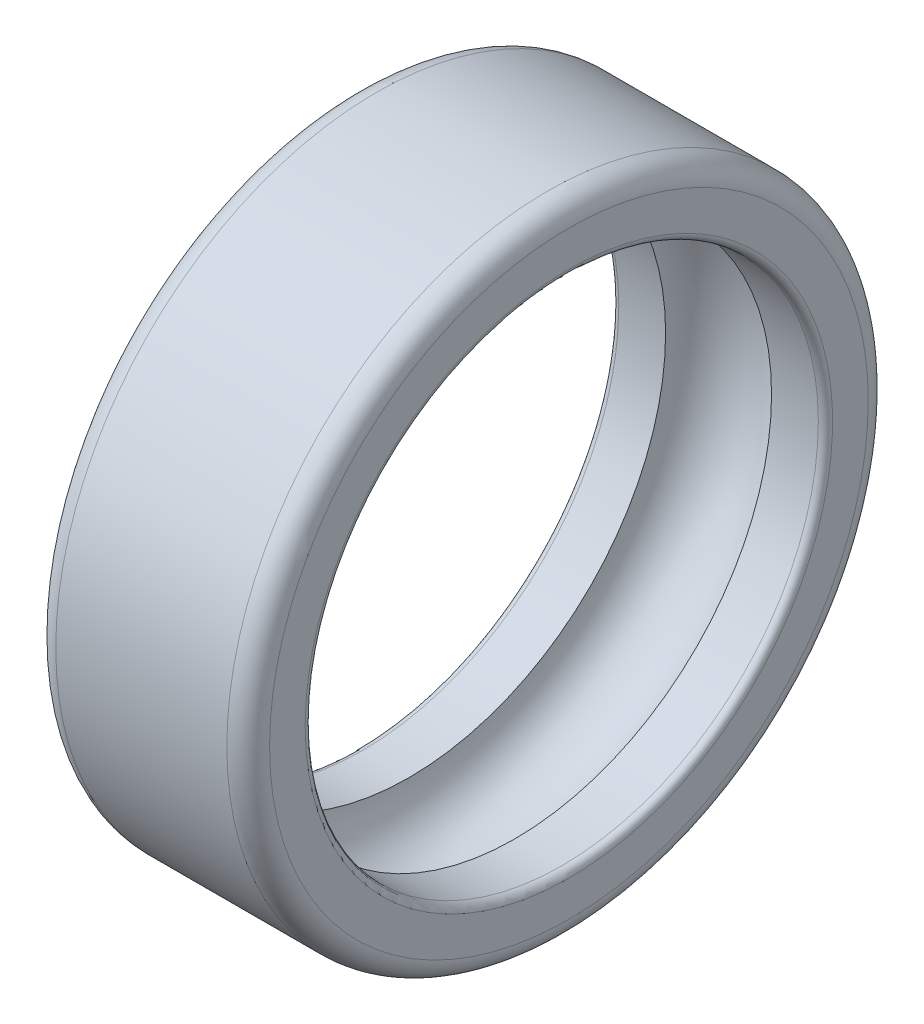
ISO-10303-21;
HEADER;
FILE_DESCRIPTION(('STEP AP214'),'2;1');
FILE_NAME('part.step','',(''),(''),'','','');
FILE_SCHEMA(('AUTOMOTIVE_DESIGN { 1 0 10303 214 1 1 1 1 }'));
ENDSEC;
DATA;
#1=APPLICATION_CONTEXT('core data for automotive mechanical design processes');
#2=APPLICATION_PROTOCOL_DEFINITION('international standard','automotive_design',2000,#1);
#3=PRODUCT_CONTEXT('',#1,'mechanical');
#4=PRODUCT('Part','Part','',(#3));
#5=PRODUCT_RELATED_PRODUCT_CATEGORY('part','',(#4));
#6=PRODUCT_DEFINITION_FORMATION('','',#4);
#7=PRODUCT_DEFINITION_CONTEXT('part definition',#1,'design');
#8=PRODUCT_DEFINITION('design','',#6,#7);
#9=PRODUCT_DEFINITION_SHAPE('','',#8);
#10=(LENGTH_UNIT() NAMED_UNIT(*) SI_UNIT(.MILLI.,.METRE.));
#11=(NAMED_UNIT(*) PLANE_ANGLE_UNIT() SI_UNIT($,.RADIAN.));
#12=(NAMED_UNIT(*) SI_UNIT($,.STERADIAN.) SOLID_ANGLE_UNIT());
#13=UNCERTAINTY_MEASURE_WITH_UNIT(LENGTH_MEASURE(1.E-05),#10,'distance_accuracy_value','');
#14=(GEOMETRIC_REPRESENTATION_CONTEXT(3) GLOBAL_UNCERTAINTY_ASSIGNED_CONTEXT((#13)) GLOBAL_UNIT_ASSIGNED_CONTEXT((#10,
#11,#12)) REPRESENTATION_CONTEXT('',''));
#15=CARTESIAN_POINT('',(0.,0.,0.));
#16=DIRECTION('',(0.,0.,1.));
#17=DIRECTION('',(1.,0.,0.));
#18=AXIS2_PLACEMENT_3D('',#15,#16,#17);
#19=CARTESIAN_POINT('',(6.9,13.05,0.));
#20=DIRECTION('',(-1.,0.,0.));
#21=DIRECTION('',(0.,0.,1.));
#22=AXIS2_PLACEMENT_3D('',#19,#20,#21);
#23=TOROIDAL_SURFACE('',#22,3.7,0.099999999999999);
#24=CARTESIAN_POINT('',(6.9,13.05,0.));
#25=DIRECTION('',(-1.,0.,0.));
#26=DIRECTION('',(0.,0.,1.));
#27=AXIS2_PLACEMENT_3D('',#24,#25,#26);
#28=CIRCLE('',#27,3.6);
#29=CARTESIAN_POINT('',(6.9,13.05,3.6));
#30=VERTEX_POINT('',#29);
#31=EDGE_CURVE('E10',#30,#30,#28,.T.);
#32=ORIENTED_EDGE('',*,*,#31,.T.);
#33=EDGE_LOOP('',(#32));
#34=FACE_BOUND('',#33,.T.);
#35=CARTESIAN_POINT('',(7.,13.05,0.));
#36=DIRECTION('',(-1.,0.,0.));
#37=DIRECTION('',(0.,0.,1.));
#38=AXIS2_PLACEMENT_3D('',#35,#36,#37);
#39=CIRCLE('',#38,3.7);
#40=CARTESIAN_POINT('',(7.,13.05,3.7));
#41=VERTEX_POINT('',#40);
#42=EDGE_CURVE('E69',#41,#41,#39,.T.);
#43=ORIENTED_EDGE('',*,*,#42,.F.);
#44=EDGE_LOOP('',(#43));
#45=FACE_BOUND('',#44,.T.);
#46=ADVANCED_FACE('F35',(#34,#45),#23,.T.);
#47=CARTESIAN_POINT('',(8.05139978139664,13.05,0.));
#48=DIRECTION('',(-1.,0.,0.));
#49=DIRECTION('',(0.,0.,1.));
#50=AXIS2_PLACEMENT_3D('',#47,#48,#49);
#51=CYLINDRICAL_SURFACE('',#50,3.6);
#52=CARTESIAN_POINT('',(6.24330343736593,13.05,0.));
#53=DIRECTION('',(-1.,0.,0.));
#54=DIRECTION('',(0.,0.,1.));
#55=AXIS2_PLACEMENT_3D('',#52,#53,#54);
#56=CIRCLE('',#55,3.6);
#57=CARTESIAN_POINT('',(6.24330343736593,13.05,3.6));
#58=VERTEX_POINT('',#57);
#59=EDGE_CURVE('E41',#58,#58,#56,.T.);
#60=ORIENTED_EDGE('',*,*,#59,.T.);
#61=EDGE_LOOP('',(#60));
#62=FACE_BOUND('',#61,.T.);
#63=ORIENTED_EDGE('',*,*,#31,.F.);
#64=EDGE_LOOP('',(#63));
#65=FACE_BOUND('',#64,.T.);
#66=ADVANCED_FACE('F77',(#62,#65),#51,.F.);
#67=CARTESIAN_POINT('',(5.5,13.05,0.));
#68=DIRECTION('',(-1.,0.,0.));
#69=DIRECTION('',(0.,0.,1.));
#70=AXIS2_PLACEMENT_3D('',#67,#68,#69);
#71=TOROIDAL_SURFACE('',#70,3.5,0.75);
#72=CARTESIAN_POINT('',(4.75669656263408,13.05,0.));
#73=DIRECTION('',(-1.,0.,0.));
#74=DIRECTION('',(0.,0.,1.));
#75=AXIS2_PLACEMENT_3D('',#72,#73,#74);
#76=CIRCLE('',#75,3.6);
#77=CARTESIAN_POINT('',(4.75669656263408,13.05,3.6));
#78=VERTEX_POINT('',#77);
#79=EDGE_CURVE('E45',#78,#78,#76,.T.);
#80=ORIENTED_EDGE('',*,*,#79,.T.);
#81=EDGE_LOOP('',(#80));
#82=FACE_BOUND('',#81,.T.);
#83=ORIENTED_EDGE('',*,*,#59,.F.);
#84=EDGE_LOOP('',(#83));
#85=FACE_BOUND('',#84,.T.);
#86=ADVANCED_FACE('F81',(#82,#85),#71,.F.);
#87=CARTESIAN_POINT('',(8.05139978139664,13.05,0.));
#88=DIRECTION('',(-1.,0.,0.));
#89=DIRECTION('',(0.,0.,1.));
#90=AXIS2_PLACEMENT_3D('',#87,#88,#89);
#91=CYLINDRICAL_SURFACE('',#90,3.6);
#92=CARTESIAN_POINT('',(4.1,13.05,0.));
#93=DIRECTION('',(-1.,0.,0.));
#94=DIRECTION('',(0.,0.,1.));
#95=AXIS2_PLACEMENT_3D('',#92,#93,#94);
#96=CIRCLE('',#95,3.6);
#97=CARTESIAN_POINT('',(4.1,13.05,3.6));
#98=VERTEX_POINT('',#97);
#99=EDGE_CURVE('E49',#98,#98,#96,.T.);
#100=ORIENTED_EDGE('',*,*,#99,.T.);
#101=EDGE_LOOP('',(#100));
#102=FACE_BOUND('',#101,.T.);
#103=ORIENTED_EDGE('',*,*,#79,.F.);
#104=EDGE_LOOP('',(#103));
#105=FACE_BOUND('',#104,.T.);
#106=ADVANCED_FACE('F85',(#102,#105),#91,.F.);
#107=CARTESIAN_POINT('',(4.1,13.05,0.));
#108=DIRECTION('',(-1.,0.,0.));
#109=DIRECTION('',(0.,0.,1.));
#110=AXIS2_PLACEMENT_3D('',#107,#108,#109);
#111=TOROIDAL_SURFACE('',#110,3.7,0.100000000000003);
#112=CARTESIAN_POINT('',(4.,13.05,0.));
#113=DIRECTION('',(-1.,0.,0.));
#114=DIRECTION('',(0.,0.,1.));
#115=AXIS2_PLACEMENT_3D('',#112,#113,#114);
#116=CIRCLE('',#115,3.7);
#117=CARTESIAN_POINT('',(4.,13.05,3.7));
#118=VERTEX_POINT('',#117);
#119=EDGE_CURVE('E54',#118,#118,#116,.T.);
#120=ORIENTED_EDGE('',*,*,#119,.T.);
#121=EDGE_LOOP('',(#120));
#122=FACE_BOUND('',#121,.T.);
#123=ORIENTED_EDGE('',*,*,#99,.F.);
#124=EDGE_LOOP('',(#123));
#125=FACE_BOUND('',#124,.T.);
#126=ADVANCED_FACE('F92',(#122,#125),#111,.T.);
#127=CARTESIAN_POINT('',(4.,16.75,0.));
#128=DIRECTION('',(-1.,0.,0.));
#129=DIRECTION('',(0.,0.,1.));
#130=AXIS2_PLACEMENT_3D('',#127,#128,#129);
#131=PLANE('',#130);
#132=CARTESIAN_POINT('',(4.,13.05,0.));
#133=DIRECTION('',(-1.,0.,0.));
#134=DIRECTION('',(0.,0.,1.));
#135=AXIS2_PLACEMENT_3D('',#132,#133,#134);
#136=CIRCLE('',#135,4.2);
#137=CARTESIAN_POINT('',(4.,13.05,4.2));
#138=VERTEX_POINT('',#137);
#139=EDGE_CURVE('E57',#138,#138,#136,.T.);
#140=ORIENTED_EDGE('',*,*,#139,.T.);
#141=EDGE_LOOP('',(#140));
#142=FACE_BOUND('',#141,.T.);
#143=ORIENTED_EDGE('',*,*,#119,.F.);
#144=EDGE_LOOP('',(#143));
#145=FACE_BOUND('',#144,.T.);
#146=ADVANCED_FACE('F96',(#142,#145),#131,.T.);
#147=CARTESIAN_POINT('',(4.3,13.05,0.));
#148=DIRECTION('',(-1.,0.,0.));
#149=DIRECTION('',(0.,0.,1.));
#150=AXIS2_PLACEMENT_3D('',#147,#148,#149);
#151=TOROIDAL_SURFACE('',#150,4.2,0.300000000000002);
#152=CARTESIAN_POINT('',(4.3,13.05,0.));
#153=DIRECTION('',(-1.,0.,0.));
#154=DIRECTION('',(0.,0.,1.));
#155=AXIS2_PLACEMENT_3D('',#152,#153,#154);
#156=CIRCLE('',#155,4.5);
#157=CARTESIAN_POINT('',(4.3,13.05,4.5));
#158=VERTEX_POINT('',#157);
#159=EDGE_CURVE('E60',#158,#158,#156,.T.);
#160=ORIENTED_EDGE('',*,*,#159,.T.);
#161=EDGE_LOOP('',(#160));
#162=FACE_BOUND('',#161,.T.);
#163=ORIENTED_EDGE('',*,*,#139,.F.);
#164=EDGE_LOOP('',(#163));
#165=FACE_BOUND('',#164,.T.);
#166=ADVANCED_FACE('F100',(#162,#165),#151,.T.);
#167=CARTESIAN_POINT('',(8.05139978139664,13.05,0.));
#168=DIRECTION('',(-1.,0.,0.));
#169=DIRECTION('',(0.,0.,1.));
#170=AXIS2_PLACEMENT_3D('',#167,#168,#169);
#171=CYLINDRICAL_SURFACE('',#170,4.5);
#172=CARTESIAN_POINT('',(6.7,13.05,0.));
#173=DIRECTION('',(-1.,0.,0.));
#174=DIRECTION('',(0.,0.,1.));
#175=AXIS2_PLACEMENT_3D('',#172,#173,#174);
#176=CIRCLE('',#175,4.5);
#177=CARTESIAN_POINT('',(6.7,13.05,4.5));
#178=VERTEX_POINT('',#177);
#179=EDGE_CURVE('E63',#178,#178,#176,.T.);
#180=ORIENTED_EDGE('',*,*,#179,.T.);
#181=EDGE_LOOP('',(#180));
#182=FACE_BOUND('',#181,.T.);
#183=ORIENTED_EDGE('',*,*,#159,.F.);
#184=EDGE_LOOP('',(#183));
#185=FACE_BOUND('',#184,.T.);
#186=ADVANCED_FACE('F104',(#182,#185),#171,.T.);
#187=CARTESIAN_POINT('',(6.7,13.05,0.));
#188=DIRECTION('',(-1.,0.,0.));
#189=DIRECTION('',(0.,0.,1.));
#190=AXIS2_PLACEMENT_3D('',#187,#188,#189);
#191=TOROIDAL_SURFACE('',#190,4.2,0.299999999999998);
#192=CARTESIAN_POINT('',(7.,13.05,0.));
#193=DIRECTION('',(-1.,0.,0.));
#194=DIRECTION('',(0.,0.,1.));
#195=AXIS2_PLACEMENT_3D('',#192,#193,#194);
#196=CIRCLE('',#195,4.2);
#197=CARTESIAN_POINT('',(7.,13.05,4.2));
#198=VERTEX_POINT('',#197);
#199=EDGE_CURVE('E66',#198,#198,#196,.T.);
#200=ORIENTED_EDGE('',*,*,#199,.T.);
#201=EDGE_LOOP('',(#200));
#202=FACE_BOUND('',#201,.T.);
#203=ORIENTED_EDGE('',*,*,#179,.F.);
#204=EDGE_LOOP('',(#203));
#205=FACE_BOUND('',#204,.T.);
#206=ADVANCED_FACE('F108',(#202,#205),#191,.T.);
#207=CARTESIAN_POINT('',(7.,17.25,0.));
#208=DIRECTION('',(1.,0.,0.));
#209=DIRECTION('',(0.,0.,-1.));
#210=AXIS2_PLACEMENT_3D('',#207,#208,#209);
#211=PLANE('',#210);
#212=ORIENTED_EDGE('',*,*,#42,.T.);
#213=EDGE_LOOP('',(#212));
#214=FACE_BOUND('',#213,.T.);
#215=ORIENTED_EDGE('',*,*,#199,.F.);
#216=EDGE_LOOP('',(#215));
#217=FACE_BOUND('',#216,.T.);
#218=ADVANCED_FACE('F73',(#214,#217),#211,.T.);
#219=CLOSED_SHELL('',(#46,#66,#86,#106,#126,#146,#166,#186,#206,#218));
#220=MANIFOLD_SOLID_BREP('B2',#219);
#221=ADVANCED_BREP_SHAPE_REPRESENTATION('',(#18,#220),#14);
#222=SHAPE_DEFINITION_REPRESENTATION(#9,#221);
ENDSEC;
END-ISO-10303-21;
